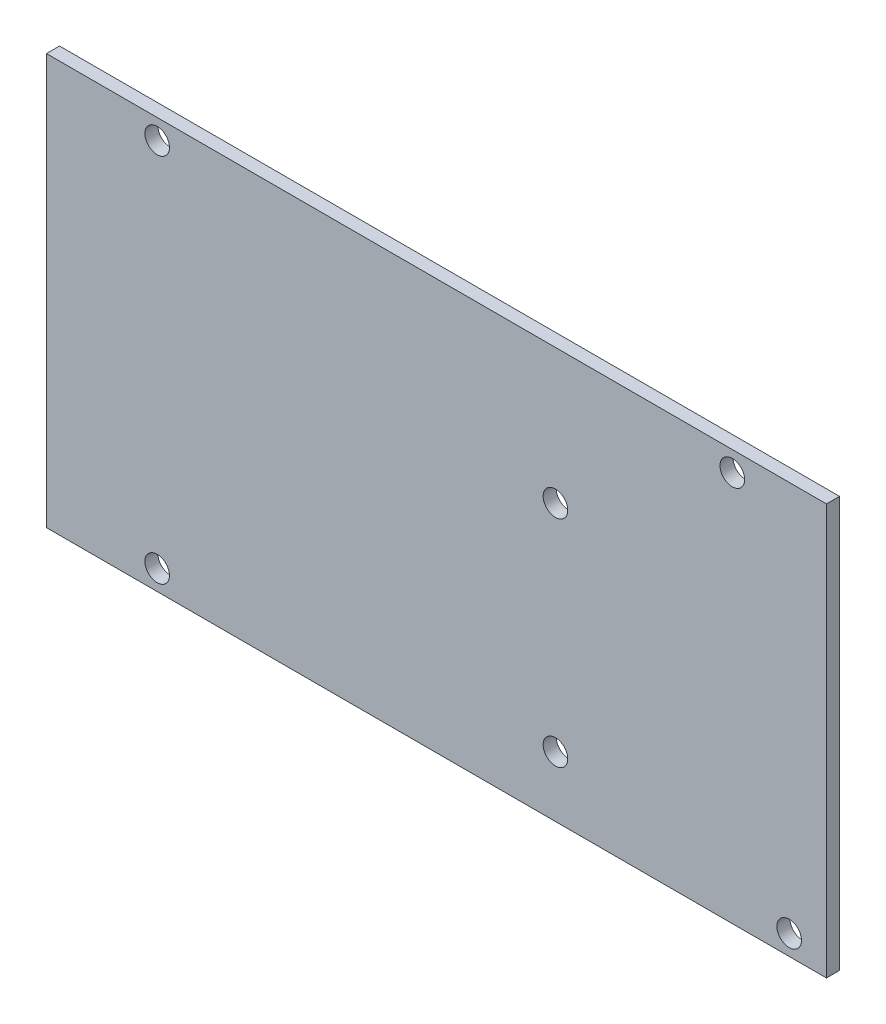
ISO-10303-21;
HEADER;
FILE_DESCRIPTION(('STEP AP214'),'2;1');
FILE_NAME('part.step','',(''),(''),'','','');
FILE_SCHEMA(('AUTOMOTIVE_DESIGN { 1 0 10303 214 1 1 1 1 }'));
ENDSEC;
DATA;
#1=APPLICATION_CONTEXT('core data for automotive mechanical design processes');
#2=APPLICATION_PROTOCOL_DEFINITION('international standard','automotive_design',2000,#1);
#3=PRODUCT_CONTEXT('',#1,'mechanical');
#4=PRODUCT('Part','Part','',(#3));
#5=PRODUCT_RELATED_PRODUCT_CATEGORY('part','',(#4));
#6=PRODUCT_DEFINITION_FORMATION('','',#4);
#7=PRODUCT_DEFINITION_CONTEXT('part definition',#1,'design');
#8=PRODUCT_DEFINITION('design','',#6,#7);
#9=PRODUCT_DEFINITION_SHAPE('','',#8);
#10=(LENGTH_UNIT() NAMED_UNIT(*) SI_UNIT(.MILLI.,.METRE.));
#11=(NAMED_UNIT(*) PLANE_ANGLE_UNIT() SI_UNIT($,.RADIAN.));
#12=(NAMED_UNIT(*) SI_UNIT($,.STERADIAN.) SOLID_ANGLE_UNIT());
#13=UNCERTAINTY_MEASURE_WITH_UNIT(LENGTH_MEASURE(1.E-05),#10,'distance_accuracy_value','');
#14=(GEOMETRIC_REPRESENTATION_CONTEXT(3) GLOBAL_UNCERTAINTY_ASSIGNED_CONTEXT((#13)) GLOBAL_UNIT_ASSIGNED_CONTEXT((#10,
#11,#12)) REPRESENTATION_CONTEXT('',''));
#15=CARTESIAN_POINT('',(0.,0.,0.));
#16=DIRECTION('',(0.,0.,1.));
#17=DIRECTION('',(1.,0.,0.));
#18=AXIS2_PLACEMENT_3D('',#15,#16,#17);
#19=CARTESIAN_POINT('',(0.,0.,1.7));
#20=DIRECTION('',(0.,0.,-1.));
#21=DIRECTION('',(-1.,0.,0.));
#22=AXIS2_PLACEMENT_3D('',#19,#20,#21);
#23=PLANE('',#22);
#24=DIRECTION('',(0.,1.,0.));
#25=VECTOR('',#24,1.);
#26=CARTESIAN_POINT('',(50.725,-26.7,1.7));
#27=LINE('',#26,#25);
#28=CARTESIAN_POINT('',(50.725,-26.7,1.7));
#29=VERTEX_POINT('',#28);
#30=CARTESIAN_POINT('',(50.725,26.7,1.7));
#31=VERTEX_POINT('',#30);
#32=EDGE_CURVE('E88',#29,#31,#27,.T.);
#33=ORIENTED_EDGE('',*,*,#32,.T.);
#34=DIRECTION('',(-1.,0.,0.));
#35=VECTOR('',#34,1.);
#36=CARTESIAN_POINT('',(-50.725,26.7,1.7));
#37=LINE('',#36,#35);
#38=CARTESIAN_POINT('',(-50.725,26.7,1.7));
#39=VERTEX_POINT('',#38);
#40=EDGE_CURVE('E83',#31,#39,#37,.T.);
#41=ORIENTED_EDGE('',*,*,#40,.T.);
#42=DIRECTION('',(0.,-1.,0.));
#43=VECTOR('',#42,1.);
#44=CARTESIAN_POINT('',(-50.725,-26.7,1.7));
#45=LINE('',#44,#43);
#46=CARTESIAN_POINT('',(-50.725,-26.7,1.7));
#47=VERTEX_POINT('',#46);
#48=EDGE_CURVE('E86',#39,#47,#45,.T.);
#49=ORIENTED_EDGE('',*,*,#48,.T.);
#50=DIRECTION('',(1.,0.,0.));
#51=VECTOR('',#50,1.);
#52=CARTESIAN_POINT('',(-50.725,-26.7,1.7));
#53=LINE('',#52,#51);
#54=EDGE_CURVE('E53',#47,#29,#53,.T.);
#55=ORIENTED_EDGE('',*,*,#54,.T.);
#56=EDGE_LOOP('',(#33,#41,#49,#55));
#57=FACE_BOUND('',#56,.T.);
#58=CARTESIAN_POINT('',(-36.325,24.1,1.7));
#59=DIRECTION('',(0.,0.,1.));
#60=DIRECTION('',(1.,0.,0.));
#61=AXIS2_PLACEMENT_3D('',#58,#59,#60);
#62=CIRCLE('',#61,1.6);
#63=CARTESIAN_POINT('',(-34.725,24.1,1.7));
#64=VERTEX_POINT('',#63);
#65=EDGE_CURVE('E103',#64,#64,#62,.T.);
#66=ORIENTED_EDGE('',*,*,#65,.F.);
#67=EDGE_LOOP('',(#66));
#68=FACE_BOUND('',#67,.T.);
#69=CARTESIAN_POINT('',(-36.325,-24.1,1.7));
#70=DIRECTION('',(0.,0.,1.));
#71=DIRECTION('',(1.,0.,0.));
#72=AXIS2_PLACEMENT_3D('',#69,#70,#71);
#73=CIRCLE('',#72,1.6);
#74=CARTESIAN_POINT('',(-34.725,-24.1,1.7));
#75=VERTEX_POINT('',#74);
#76=EDGE_CURVE('E118',#75,#75,#73,.T.);
#77=ORIENTED_EDGE('',*,*,#76,.F.);
#78=EDGE_LOOP('',(#77));
#79=FACE_BOUND('',#78,.T.);
#80=CARTESIAN_POINT('',(15.475,-18.85,1.7));
#81=DIRECTION('',(0.,0.,1.));
#82=DIRECTION('',(1.,0.,0.));
#83=AXIS2_PLACEMENT_3D('',#80,#81,#82);
#84=CIRCLE('',#83,1.6);
#85=CARTESIAN_POINT('',(17.075,-18.85,1.7));
#86=VERTEX_POINT('',#85);
#87=EDGE_CURVE('E124',#86,#86,#84,.T.);
#88=ORIENTED_EDGE('',*,*,#87,.F.);
#89=EDGE_LOOP('',(#88));
#90=FACE_BOUND('',#89,.T.);
#91=CARTESIAN_POINT('',(15.475,9.15,1.7));
#92=DIRECTION('',(0.,0.,1.));
#93=DIRECTION('',(1.,0.,0.));
#94=AXIS2_PLACEMENT_3D('',#91,#92,#93);
#95=CIRCLE('',#94,1.6);
#96=CARTESIAN_POINT('',(17.075,9.15,1.7));
#97=VERTEX_POINT('',#96);
#98=EDGE_CURVE('E130',#97,#97,#95,.T.);
#99=ORIENTED_EDGE('',*,*,#98,.F.);
#100=EDGE_LOOP('',(#99));
#101=FACE_BOUND('',#100,.T.);
#102=CARTESIAN_POINT('',(38.475,24.1,1.7));
#103=DIRECTION('',(0.,0.,1.));
#104=DIRECTION('',(1.,0.,0.));
#105=AXIS2_PLACEMENT_3D('',#102,#103,#104);
#106=CIRCLE('',#105,1.6);
#107=CARTESIAN_POINT('',(40.075,24.1,1.7));
#108=VERTEX_POINT('',#107);
#109=EDGE_CURVE('E136',#108,#108,#106,.T.);
#110=ORIENTED_EDGE('',*,*,#109,.F.);
#111=EDGE_LOOP('',(#110));
#112=FACE_BOUND('',#111,.T.);
#113=CARTESIAN_POINT('',(45.875,-24.1,1.7));
#114=DIRECTION('',(0.,0.,1.));
#115=DIRECTION('',(1.,0.,0.));
#116=AXIS2_PLACEMENT_3D('',#113,#114,#115);
#117=CIRCLE('',#116,1.6);
#118=CARTESIAN_POINT('',(47.475,-24.1,1.7));
#119=VERTEX_POINT('',#118);
#120=EDGE_CURVE('E142',#119,#119,#117,.T.);
#121=ORIENTED_EDGE('',*,*,#120,.F.);
#122=EDGE_LOOP('',(#121));
#123=FACE_BOUND('',#122,.T.);
#124=ADVANCED_FACE('F36',(#57,#68,#79,#90,#101,#112,#123),#23,.F.);
#125=CARTESIAN_POINT('',(0.,0.,0.));
#126=DIRECTION('',(0.,0.,-1.));
#127=DIRECTION('',(-1.,0.,0.));
#128=AXIS2_PLACEMENT_3D('',#125,#126,#127);
#129=PLANE('',#128);
#130=CARTESIAN_POINT('',(38.475,24.1,0.));
#131=DIRECTION('',(0.,0.,1.));
#132=DIRECTION('',(1.,0.,0.));
#133=AXIS2_PLACEMENT_3D('',#130,#131,#132);
#134=CIRCLE('',#133,1.6);
#135=CARTESIAN_POINT('',(40.075,24.1,0.));
#136=VERTEX_POINT('',#135);
#137=EDGE_CURVE('E139',#136,#136,#134,.T.);
#138=ORIENTED_EDGE('',*,*,#137,.T.);
#139=EDGE_LOOP('',(#138));
#140=FACE_BOUND('',#139,.T.);
#141=CARTESIAN_POINT('',(15.475,-18.85,0.));
#142=DIRECTION('',(0.,0.,1.));
#143=DIRECTION('',(1.,0.,0.));
#144=AXIS2_PLACEMENT_3D('',#141,#142,#143);
#145=CIRCLE('',#144,1.6);
#146=CARTESIAN_POINT('',(17.075,-18.85,0.));
#147=VERTEX_POINT('',#146);
#148=EDGE_CURVE('E127',#147,#147,#145,.T.);
#149=ORIENTED_EDGE('',*,*,#148,.T.);
#150=EDGE_LOOP('',(#149));
#151=FACE_BOUND('',#150,.T.);
#152=CARTESIAN_POINT('',(-36.325,24.1,0.));
#153=DIRECTION('',(0.,0.,1.));
#154=DIRECTION('',(1.,0.,0.));
#155=AXIS2_PLACEMENT_3D('',#152,#153,#154);
#156=CIRCLE('',#155,1.6);
#157=CARTESIAN_POINT('',(-34.725,24.1,0.));
#158=VERTEX_POINT('',#157);
#159=EDGE_CURVE('E115',#158,#158,#156,.T.);
#160=ORIENTED_EDGE('',*,*,#159,.T.);
#161=EDGE_LOOP('',(#160));
#162=FACE_BOUND('',#161,.T.);
#163=DIRECTION('',(0.,1.,0.));
#164=VECTOR('',#163,1.);
#165=CARTESIAN_POINT('',(50.725,-26.7,0.));
#166=LINE('',#165,#164);
#167=CARTESIAN_POINT('',(50.725,-26.7,0.));
#168=VERTEX_POINT('',#167);
#169=CARTESIAN_POINT('',(50.725,26.7,0.));
#170=VERTEX_POINT('',#169);
#171=EDGE_CURVE('E100',#168,#170,#166,.T.);
#172=ORIENTED_EDGE('',*,*,#171,.F.);
#173=DIRECTION('',(1.,0.,0.));
#174=VECTOR('',#173,1.);
#175=CARTESIAN_POINT('',(-50.725,-26.7,0.));
#176=LINE('',#175,#174);
#177=CARTESIAN_POINT('',(-50.725,-26.7,0.));
#178=VERTEX_POINT('',#177);
#179=EDGE_CURVE('E76',#178,#168,#176,.T.);
#180=ORIENTED_EDGE('',*,*,#179,.F.);
#181=DIRECTION('',(0.,-1.,0.));
#182=VECTOR('',#181,1.);
#183=CARTESIAN_POINT('',(-50.725,-26.7,0.));
#184=LINE('',#183,#182);
#185=CARTESIAN_POINT('',(-50.725,26.7,0.));
#186=VERTEX_POINT('',#185);
#187=EDGE_CURVE('E70',#186,#178,#184,.T.);
#188=ORIENTED_EDGE('',*,*,#187,.F.);
#189=DIRECTION('',(-1.,0.,0.));
#190=VECTOR('',#189,1.);
#191=CARTESIAN_POINT('',(-50.725,26.7,0.));
#192=LINE('',#191,#190);
#193=EDGE_CURVE('E92',#170,#186,#192,.T.);
#194=ORIENTED_EDGE('',*,*,#193,.F.);
#195=EDGE_LOOP('',(#172,#180,#188,#194));
#196=FACE_BOUND('',#195,.T.);
#197=CARTESIAN_POINT('',(-36.325,-24.1,0.));
#198=DIRECTION('',(0.,0.,1.));
#199=DIRECTION('',(1.,0.,0.));
#200=AXIS2_PLACEMENT_3D('',#197,#198,#199);
#201=CIRCLE('',#200,1.6);
#202=CARTESIAN_POINT('',(-34.725,-24.1,0.));
#203=VERTEX_POINT('',#202);
#204=EDGE_CURVE('E121',#203,#203,#201,.T.);
#205=ORIENTED_EDGE('',*,*,#204,.T.);
#206=EDGE_LOOP('',(#205));
#207=FACE_BOUND('',#206,.T.);
#208=CARTESIAN_POINT('',(15.475,9.15,0.));
#209=DIRECTION('',(0.,0.,1.));
#210=DIRECTION('',(1.,0.,0.));
#211=AXIS2_PLACEMENT_3D('',#208,#209,#210);
#212=CIRCLE('',#211,1.6);
#213=CARTESIAN_POINT('',(17.075,9.15,0.));
#214=VERTEX_POINT('',#213);
#215=EDGE_CURVE('E133',#214,#214,#212,.T.);
#216=ORIENTED_EDGE('',*,*,#215,.T.);
#217=EDGE_LOOP('',(#216));
#218=FACE_BOUND('',#217,.T.);
#219=CARTESIAN_POINT('',(45.875,-24.1,0.));
#220=DIRECTION('',(0.,0.,1.));
#221=DIRECTION('',(1.,0.,0.));
#222=AXIS2_PLACEMENT_3D('',#219,#220,#221);
#223=CIRCLE('',#222,1.6);
#224=CARTESIAN_POINT('',(47.475,-24.1,0.));
#225=VERTEX_POINT('',#224);
#226=EDGE_CURVE('E145',#225,#225,#223,.T.);
#227=ORIENTED_EDGE('',*,*,#226,.T.);
#228=EDGE_LOOP('',(#227));
#229=FACE_BOUND('',#228,.T.);
#230=ADVANCED_FACE('F111',(#140,#151,#162,#196,#207,#218,#229),#129,.T.);
#231=CARTESIAN_POINT('',(50.725,-26.7,1.7));
#232=DIRECTION('',(-1.,0.,0.));
#233=DIRECTION('',(0.,0.,1.));
#234=AXIS2_PLACEMENT_3D('',#231,#232,#233);
#235=PLANE('',#234);
#236=ORIENTED_EDGE('',*,*,#171,.T.);
#237=DIRECTION('',(0.,0.,-1.));
#238=VECTOR('',#237,1.);
#239=CARTESIAN_POINT('',(50.725,26.7,1.7));
#240=LINE('',#239,#238);
#241=EDGE_CURVE('E11',#31,#170,#240,.T.);
#242=ORIENTED_EDGE('',*,*,#241,.F.);
#243=ORIENTED_EDGE('',*,*,#32,.F.);
#244=DIRECTION('',(0.,0.,-1.));
#245=VECTOR('',#244,1.);
#246=CARTESIAN_POINT('',(50.725,-26.7,1.7));
#247=LINE('',#246,#245);
#248=EDGE_CURVE('E96',#29,#168,#247,.T.);
#249=ORIENTED_EDGE('',*,*,#248,.T.);
#250=EDGE_LOOP('',(#236,#242,#243,#249));
#251=FACE_BOUND('',#250,.T.);
#252=ADVANCED_FACE('F38',(#251),#235,.F.);
#253=CARTESIAN_POINT('',(-50.725,26.7,1.7));
#254=DIRECTION('',(0.,-1.,0.));
#255=DIRECTION('',(0.,0.,-1.));
#256=AXIS2_PLACEMENT_3D('',#253,#254,#255);
#257=PLANE('',#256);
#258=ORIENTED_EDGE('',*,*,#193,.T.);
#259=DIRECTION('',(0.,0.,-1.));
#260=VECTOR('',#259,1.);
#261=CARTESIAN_POINT('',(-50.725,26.7,1.7));
#262=LINE('',#261,#260);
#263=EDGE_CURVE('E45',#39,#186,#262,.T.);
#264=ORIENTED_EDGE('',*,*,#263,.F.);
#265=ORIENTED_EDGE('',*,*,#40,.F.);
#266=ORIENTED_EDGE('',*,*,#241,.T.);
#267=EDGE_LOOP('',(#258,#264,#265,#266));
#268=FACE_BOUND('',#267,.T.);
#269=ADVANCED_FACE('F91',(#268),#257,.F.);
#270=CARTESIAN_POINT('',(-50.725,-26.7,1.7));
#271=DIRECTION('',(1.,0.,0.));
#272=DIRECTION('',(0.,0.,-1.));
#273=AXIS2_PLACEMENT_3D('',#270,#271,#272);
#274=PLANE('',#273);
#275=ORIENTED_EDGE('',*,*,#187,.T.);
#276=DIRECTION('',(0.,0.,-1.));
#277=VECTOR('',#276,1.);
#278=CARTESIAN_POINT('',(-50.725,-26.7,1.7));
#279=LINE('',#278,#277);
#280=EDGE_CURVE('E93',#47,#178,#279,.T.);
#281=ORIENTED_EDGE('',*,*,#280,.F.);
#282=ORIENTED_EDGE('',*,*,#48,.F.);
#283=ORIENTED_EDGE('',*,*,#263,.T.);
#284=EDGE_LOOP('',(#275,#281,#282,#283));
#285=FACE_BOUND('',#284,.T.);
#286=ADVANCED_FACE('F94',(#285),#274,.F.);
#287=CARTESIAN_POINT('',(-50.725,-26.7,1.7));
#288=DIRECTION('',(0.,1.,0.));
#289=DIRECTION('',(0.,0.,1.));
#290=AXIS2_PLACEMENT_3D('',#287,#288,#289);
#291=PLANE('',#290);
#292=ORIENTED_EDGE('',*,*,#179,.T.);
#293=ORIENTED_EDGE('',*,*,#248,.F.);
#294=ORIENTED_EDGE('',*,*,#54,.F.);
#295=ORIENTED_EDGE('',*,*,#280,.T.);
#296=EDGE_LOOP('',(#292,#293,#294,#295));
#297=FACE_BOUND('',#296,.T.);
#298=ADVANCED_FACE('F108',(#297),#291,.F.);
#299=CARTESIAN_POINT('',(-36.325,24.1,1.7));
#300=DIRECTION('',(0.,0.,-1.));
#301=DIRECTION('',(-1.,0.,0.));
#302=AXIS2_PLACEMENT_3D('',#299,#300,#301);
#303=CYLINDRICAL_SURFACE('',#302,1.6);
#304=ORIENTED_EDGE('',*,*,#65,.T.);
#305=EDGE_LOOP('',(#304));
#306=FACE_BOUND('',#305,.T.);
#307=ORIENTED_EDGE('',*,*,#159,.F.);
#308=EDGE_LOOP('',(#307));
#309=FACE_BOUND('',#308,.T.);
#310=ADVANCED_FACE('F162',(#306,#309),#303,.F.);
#311=CARTESIAN_POINT('',(-36.325,-24.1,1.7));
#312=DIRECTION('',(0.,0.,-1.));
#313=DIRECTION('',(-1.,0.,0.));
#314=AXIS2_PLACEMENT_3D('',#311,#312,#313);
#315=CYLINDRICAL_SURFACE('',#314,1.6);
#316=ORIENTED_EDGE('',*,*,#76,.T.);
#317=EDGE_LOOP('',(#316));
#318=FACE_BOUND('',#317,.T.);
#319=ORIENTED_EDGE('',*,*,#204,.F.);
#320=EDGE_LOOP('',(#319));
#321=FACE_BOUND('',#320,.T.);
#322=ADVANCED_FACE('F208',(#318,#321),#315,.F.);
#323=CARTESIAN_POINT('',(15.475,-18.85,1.7));
#324=DIRECTION('',(0.,0.,-1.));
#325=DIRECTION('',(-1.,0.,0.));
#326=AXIS2_PLACEMENT_3D('',#323,#324,#325);
#327=CYLINDRICAL_SURFACE('',#326,1.6);
#328=ORIENTED_EDGE('',*,*,#87,.T.);
#329=EDGE_LOOP('',(#328));
#330=FACE_BOUND('',#329,.T.);
#331=ORIENTED_EDGE('',*,*,#148,.F.);
#332=EDGE_LOOP('',(#331));
#333=FACE_BOUND('',#332,.T.);
#334=ADVANCED_FACE('F216',(#330,#333),#327,.F.);
#335=CARTESIAN_POINT('',(15.475,9.15,1.7));
#336=DIRECTION('',(0.,0.,-1.));
#337=DIRECTION('',(-1.,0.,0.));
#338=AXIS2_PLACEMENT_3D('',#335,#336,#337);
#339=CYLINDRICAL_SURFACE('',#338,1.6);
#340=ORIENTED_EDGE('',*,*,#98,.T.);
#341=EDGE_LOOP('',(#340));
#342=FACE_BOUND('',#341,.T.);
#343=ORIENTED_EDGE('',*,*,#215,.F.);
#344=EDGE_LOOP('',(#343));
#345=FACE_BOUND('',#344,.T.);
#346=ADVANCED_FACE('F224',(#342,#345),#339,.F.);
#347=CARTESIAN_POINT('',(38.475,24.1,1.7));
#348=DIRECTION('',(0.,0.,-1.));
#349=DIRECTION('',(-1.,0.,0.));
#350=AXIS2_PLACEMENT_3D('',#347,#348,#349);
#351=CYLINDRICAL_SURFACE('',#350,1.6);
#352=ORIENTED_EDGE('',*,*,#109,.T.);
#353=EDGE_LOOP('',(#352));
#354=FACE_BOUND('',#353,.T.);
#355=ORIENTED_EDGE('',*,*,#137,.F.);
#356=EDGE_LOOP('',(#355));
#357=FACE_BOUND('',#356,.T.);
#358=ADVANCED_FACE('F233',(#354,#357),#351,.F.);
#359=CARTESIAN_POINT('',(45.875,-24.1,1.7));
#360=DIRECTION('',(0.,0.,-1.));
#361=DIRECTION('',(-1.,0.,0.));
#362=AXIS2_PLACEMENT_3D('',#359,#360,#361);
#363=CYLINDRICAL_SURFACE('',#362,1.6);
#364=ORIENTED_EDGE('',*,*,#120,.T.);
#365=EDGE_LOOP('',(#364));
#366=FACE_BOUND('',#365,.T.);
#367=ORIENTED_EDGE('',*,*,#226,.F.);
#368=EDGE_LOOP('',(#367));
#369=FACE_BOUND('',#368,.T.);
#370=ADVANCED_FACE('F151',(#366,#369),#363,.F.);
#371=CLOSED_SHELL('',(#124,#230,#252,#269,#286,#298,#310,#322,#334,#346,#358,#370));
#372=MANIFOLD_SOLID_BREP('B2',#371);
#373=ADVANCED_BREP_SHAPE_REPRESENTATION('',(#18,#372),#14);
#374=SHAPE_DEFINITION_REPRESENTATION(#9,#373);
ENDSEC;
END-ISO-10303-21;
